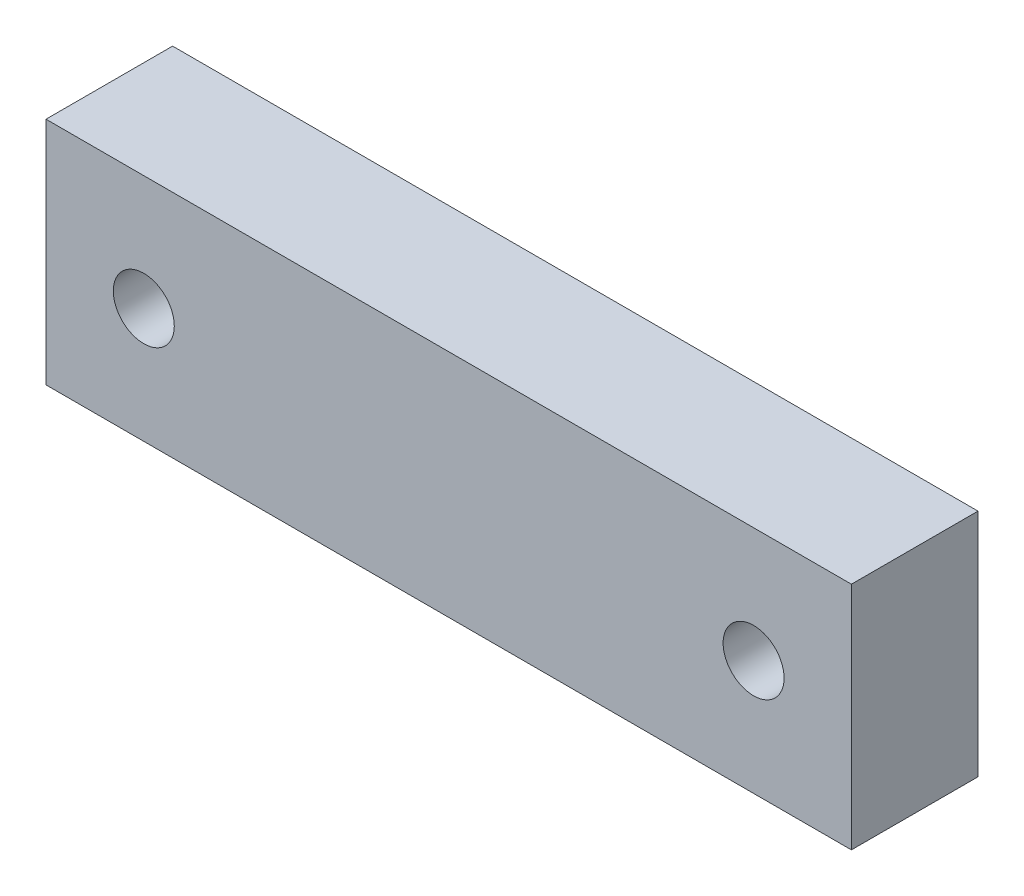
ISO-10303-21;
HEADER;
FILE_DESCRIPTION(('STEP AP214'),'2;1');
FILE_NAME('part.step','',(''),(''),'','','');
FILE_SCHEMA(('AUTOMOTIVE_DESIGN { 1 0 10303 214 1 1 1 1 }'));
ENDSEC;
DATA;
#1=APPLICATION_CONTEXT('core data for automotive mechanical design processes');
#2=APPLICATION_PROTOCOL_DEFINITION('international standard','automotive_design',2000,#1);
#3=PRODUCT_CONTEXT('',#1,'mechanical');
#4=PRODUCT('Part','Part','',(#3));
#5=PRODUCT_RELATED_PRODUCT_CATEGORY('part','',(#4));
#6=PRODUCT_DEFINITION_FORMATION('','',#4);
#7=PRODUCT_DEFINITION_CONTEXT('part definition',#1,'design');
#8=PRODUCT_DEFINITION('design','',#6,#7);
#9=PRODUCT_DEFINITION_SHAPE('','',#8);
#10=(LENGTH_UNIT() NAMED_UNIT(*) SI_UNIT(.MILLI.,.METRE.));
#11=(NAMED_UNIT(*) PLANE_ANGLE_UNIT() SI_UNIT($,.RADIAN.));
#12=(NAMED_UNIT(*) SI_UNIT($,.STERADIAN.) SOLID_ANGLE_UNIT());
#13=UNCERTAINTY_MEASURE_WITH_UNIT(LENGTH_MEASURE(1.E-05),#10,'distance_accuracy_value','');
#14=(GEOMETRIC_REPRESENTATION_CONTEXT(3) GLOBAL_UNCERTAINTY_ASSIGNED_CONTEXT((#13)) GLOBAL_UNIT_ASSIGNED_CONTEXT((#10,
#11,#12)) REPRESENTATION_CONTEXT('',''));
#15=CARTESIAN_POINT('',(0.,0.,0.));
#16=DIRECTION('',(0.,0.,1.));
#17=DIRECTION('',(1.,0.,0.));
#18=AXIS2_PLACEMENT_3D('',#15,#16,#17);
#19=CARTESIAN_POINT('',(0.,0.,11.0028734966437));
#20=DIRECTION('',(0.,0.,1.));
#21=DIRECTION('',(1.,0.,0.));
#22=AXIS2_PLACEMENT_3D('',#19,#20,#21);
#23=PLANE('',#22);
#24=CARTESIAN_POINT('',(26.5000000000002,-52.5,11.0028734966437));
#25=DIRECTION('',(0.,0.,1.));
#26=DIRECTION('',(1.,0.,0.));
#27=AXIS2_PLACEMENT_3D('',#24,#25,#26);
#28=CIRCLE('',#27,2.65);
#29=CARTESIAN_POINT('',(29.1500000000002,-52.5,11.0028734966437));
#30=VERTEX_POINT('',#29);
#31=EDGE_CURVE('E102',#30,#30,#28,.T.);
#32=ORIENTED_EDGE('',*,*,#31,.F.);
#33=EDGE_LOOP('',(#32));
#34=FACE_BOUND('',#33,.T.);
#35=DIRECTION('',(0.,-1.,0.));
#36=VECTOR('',#35,1.);
#37=CARTESIAN_POINT('',(-35.,-42.5,11.0028734966437));
#38=LINE('',#37,#36);
#39=CARTESIAN_POINT('',(-35.,-42.5,11.0028734966437));
#40=VERTEX_POINT('',#39);
#41=CARTESIAN_POINT('',(-35.,-62.5,11.0028734966437));
#42=VERTEX_POINT('',#41);
#43=EDGE_CURVE('E87',#40,#42,#38,.T.);
#44=ORIENTED_EDGE('',*,*,#43,.T.);
#45=DIRECTION('',(1.,0.,0.));
#46=VECTOR('',#45,1.);
#47=CARTESIAN_POINT('',(-35.,-62.5,11.0028734966437));
#48=LINE('',#47,#46);
#49=CARTESIAN_POINT('',(35.,-62.5,11.0028734966437));
#50=VERTEX_POINT('',#49);
#51=EDGE_CURVE('E82',#42,#50,#48,.T.);
#52=ORIENTED_EDGE('',*,*,#51,.T.);
#53=DIRECTION('',(0.,1.,0.));
#54=VECTOR('',#53,1.);
#55=CARTESIAN_POINT('',(35.,-42.5,11.0028734966437));
#56=LINE('',#55,#54);
#57=CARTESIAN_POINT('',(35.,-42.5,11.0028734966437));
#58=VERTEX_POINT('',#57);
#59=EDGE_CURVE('E85',#50,#58,#56,.T.);
#60=ORIENTED_EDGE('',*,*,#59,.T.);
#61=DIRECTION('',(-1.,0.,0.));
#62=VECTOR('',#61,1.);
#63=CARTESIAN_POINT('',(-35.,-42.5,11.0028734966437));
#64=LINE('',#63,#62);
#65=EDGE_CURVE('E52',#58,#40,#64,.T.);
#66=ORIENTED_EDGE('',*,*,#65,.T.);
#67=EDGE_LOOP('',(#44,#52,#60,#66));
#68=FACE_BOUND('',#67,.T.);
#69=CARTESIAN_POINT('',(-26.4999999999998,-52.5,11.0028734966437));
#70=DIRECTION('',(0.,0.,1.));
#71=DIRECTION('',(1.,0.,0.));
#72=AXIS2_PLACEMENT_3D('',#69,#70,#71);
#73=CIRCLE('',#72,2.65);
#74=CARTESIAN_POINT('',(-23.8499999999998,-52.5,11.0028734966437));
#75=VERTEX_POINT('',#74);
#76=EDGE_CURVE('E117',#75,#75,#73,.T.);
#77=ORIENTED_EDGE('',*,*,#76,.F.);
#78=EDGE_LOOP('',(#77));
#79=FACE_BOUND('',#78,.T.);
#80=ADVANCED_FACE('F35',(#34,#68,#79),#23,.T.);
#81=CARTESIAN_POINT('',(0.,0.,0.));
#82=DIRECTION('',(0.,0.,1.));
#83=DIRECTION('',(1.,0.,0.));
#84=AXIS2_PLACEMENT_3D('',#81,#82,#83);
#85=PLANE('',#84);
#86=DIRECTION('',(0.,-1.,0.));
#87=VECTOR('',#86,1.);
#88=CARTESIAN_POINT('',(-35.,-42.5,0.));
#89=LINE('',#88,#87);
#90=CARTESIAN_POINT('',(-35.,-42.5,0.));
#91=VERTEX_POINT('',#90);
#92=CARTESIAN_POINT('',(-35.,-62.5,0.));
#93=VERTEX_POINT('',#92);
#94=EDGE_CURVE('E99',#91,#93,#89,.T.);
#95=ORIENTED_EDGE('',*,*,#94,.F.);
#96=DIRECTION('',(-1.,0.,0.));
#97=VECTOR('',#96,1.);
#98=CARTESIAN_POINT('',(-35.,-42.5,0.));
#99=LINE('',#98,#97);
#100=CARTESIAN_POINT('',(35.,-42.5,0.));
#101=VERTEX_POINT('',#100);
#102=EDGE_CURVE('E75',#101,#91,#99,.T.);
#103=ORIENTED_EDGE('',*,*,#102,.F.);
#104=DIRECTION('',(0.,1.,0.));
#105=VECTOR('',#104,1.);
#106=CARTESIAN_POINT('',(35.,-42.5,0.));
#107=LINE('',#106,#105);
#108=CARTESIAN_POINT('',(35.,-62.5,0.));
#109=VERTEX_POINT('',#108);
#110=EDGE_CURVE('E69',#109,#101,#107,.T.);
#111=ORIENTED_EDGE('',*,*,#110,.F.);
#112=DIRECTION('',(1.,0.,0.));
#113=VECTOR('',#112,1.);
#114=CARTESIAN_POINT('',(-35.,-62.5,0.));
#115=LINE('',#114,#113);
#116=EDGE_CURVE('E91',#93,#109,#115,.T.);
#117=ORIENTED_EDGE('',*,*,#116,.F.);
#118=EDGE_LOOP('',(#95,#103,#111,#117));
#119=FACE_BOUND('',#118,.T.);
#120=CARTESIAN_POINT('',(26.5000000000002,-52.5,0.));
#121=DIRECTION('',(0.,0.,1.));
#122=DIRECTION('',(1.,0.,0.));
#123=AXIS2_PLACEMENT_3D('',#120,#121,#122);
#124=CIRCLE('',#123,2.65);
#125=CARTESIAN_POINT('',(29.1500000000002,-52.5,0.));
#126=VERTEX_POINT('',#125);
#127=EDGE_CURVE('E114',#126,#126,#124,.T.);
#128=ORIENTED_EDGE('',*,*,#127,.T.);
#129=EDGE_LOOP('',(#128));
#130=FACE_BOUND('',#129,.T.);
#131=CARTESIAN_POINT('',(-26.4999999999998,-52.5,0.));
#132=DIRECTION('',(0.,0.,1.));
#133=DIRECTION('',(1.,0.,0.));
#134=AXIS2_PLACEMENT_3D('',#131,#132,#133);
#135=CIRCLE('',#134,2.65);
#136=CARTESIAN_POINT('',(-23.8499999999998,-52.5,0.));
#137=VERTEX_POINT('',#136);
#138=EDGE_CURVE('E120',#137,#137,#135,.T.);
#139=ORIENTED_EDGE('',*,*,#138,.T.);
#140=EDGE_LOOP('',(#139));
#141=FACE_BOUND('',#140,.T.);
#142=ADVANCED_FACE('F110',(#119,#130,#141),#85,.F.);
#143=CARTESIAN_POINT('',(-35.,-42.5,11.0028734966437));
#144=DIRECTION('',(1.,0.,0.));
#145=DIRECTION('',(0.,1.,0.));
#146=AXIS2_PLACEMENT_3D('',#143,#144,#145);
#147=PLANE('',#146);
#148=ORIENTED_EDGE('',*,*,#94,.T.);
#149=DIRECTION('',(0.,0.,-1.));
#150=VECTOR('',#149,1.);
#151=CARTESIAN_POINT('',(-35.,-62.5,11.0028734966437));
#152=LINE('',#151,#150);
#153=EDGE_CURVE('E11',#42,#93,#152,.T.);
#154=ORIENTED_EDGE('',*,*,#153,.F.);
#155=ORIENTED_EDGE('',*,*,#43,.F.);
#156=DIRECTION('',(0.,0.,-1.));
#157=VECTOR('',#156,1.);
#158=CARTESIAN_POINT('',(-35.,-42.5,11.0028734966437));
#159=LINE('',#158,#157);
#160=EDGE_CURVE('E95',#40,#91,#159,.T.);
#161=ORIENTED_EDGE('',*,*,#160,.T.);
#162=EDGE_LOOP('',(#148,#154,#155,#161));
#163=FACE_BOUND('',#162,.T.);
#164=ADVANCED_FACE('F37',(#163),#147,.F.);
#165=CARTESIAN_POINT('',(-35.,-62.5,11.0028734966437));
#166=DIRECTION('',(0.,1.,0.));
#167=DIRECTION('',(0.,0.,1.));
#168=AXIS2_PLACEMENT_3D('',#165,#166,#167);
#169=PLANE('',#168);
#170=ORIENTED_EDGE('',*,*,#116,.T.);
#171=DIRECTION('',(0.,0.,-1.));
#172=VECTOR('',#171,1.);
#173=CARTESIAN_POINT('',(35.,-62.5,11.0028734966437));
#174=LINE('',#173,#172);
#175=EDGE_CURVE('E44',#50,#109,#174,.T.);
#176=ORIENTED_EDGE('',*,*,#175,.F.);
#177=ORIENTED_EDGE('',*,*,#51,.F.);
#178=ORIENTED_EDGE('',*,*,#153,.T.);
#179=EDGE_LOOP('',(#170,#176,#177,#178));
#180=FACE_BOUND('',#179,.T.);
#181=ADVANCED_FACE('F90',(#180),#169,.F.);
#182=CARTESIAN_POINT('',(35.,-42.5,11.0028734966437));
#183=DIRECTION('',(-1.,0.,0.));
#184=DIRECTION('',(0.,0.,1.));
#185=AXIS2_PLACEMENT_3D('',#182,#183,#184);
#186=PLANE('',#185);
#187=ORIENTED_EDGE('',*,*,#110,.T.);
#188=DIRECTION('',(0.,0.,-1.));
#189=VECTOR('',#188,1.);
#190=CARTESIAN_POINT('',(35.,-42.5,11.0028734966437));
#191=LINE('',#190,#189);
#192=EDGE_CURVE('E92',#58,#101,#191,.T.);
#193=ORIENTED_EDGE('',*,*,#192,.F.);
#194=ORIENTED_EDGE('',*,*,#59,.F.);
#195=ORIENTED_EDGE('',*,*,#175,.T.);
#196=EDGE_LOOP('',(#187,#193,#194,#195));
#197=FACE_BOUND('',#196,.T.);
#198=ADVANCED_FACE('F93',(#197),#186,.F.);
#199=CARTESIAN_POINT('',(-35.,-42.5,11.0028734966437));
#200=DIRECTION('',(0.,-1.,0.));
#201=DIRECTION('',(0.,0.,-1.));
#202=AXIS2_PLACEMENT_3D('',#199,#200,#201);
#203=PLANE('',#202);
#204=ORIENTED_EDGE('',*,*,#102,.T.);
#205=ORIENTED_EDGE('',*,*,#160,.F.);
#206=ORIENTED_EDGE('',*,*,#65,.F.);
#207=ORIENTED_EDGE('',*,*,#192,.T.);
#208=EDGE_LOOP('',(#204,#205,#206,#207));
#209=FACE_BOUND('',#208,.T.);
#210=ADVANCED_FACE('F107',(#209),#203,.F.);
#211=CARTESIAN_POINT('',(26.5000000000002,-52.5,11.0028734966437));
#212=DIRECTION('',(0.,0.,-1.));
#213=DIRECTION('',(-1.,0.,0.));
#214=AXIS2_PLACEMENT_3D('',#211,#212,#213);
#215=CYLINDRICAL_SURFACE('',#214,2.65);
#216=ORIENTED_EDGE('',*,*,#31,.T.);
#217=EDGE_LOOP('',(#216));
#218=FACE_BOUND('',#217,.T.);
#219=ORIENTED_EDGE('',*,*,#127,.F.);
#220=EDGE_LOOP('',(#219));
#221=FACE_BOUND('',#220,.T.);
#222=ADVANCED_FACE('F137',(#218,#221),#215,.F.);
#223=CARTESIAN_POINT('',(-26.4999999999998,-52.5,11.0028734966437));
#224=DIRECTION('',(0.,0.,-1.));
#225=DIRECTION('',(-1.,0.,0.));
#226=AXIS2_PLACEMENT_3D('',#223,#224,#225);
#227=CYLINDRICAL_SURFACE('',#226,2.65);
#228=ORIENTED_EDGE('',*,*,#76,.T.);
#229=EDGE_LOOP('',(#228));
#230=FACE_BOUND('',#229,.T.);
#231=ORIENTED_EDGE('',*,*,#138,.F.);
#232=EDGE_LOOP('',(#231));
#233=FACE_BOUND('',#232,.T.);
#234=ADVANCED_FACE('F126',(#230,#233),#227,.F.);
#235=CLOSED_SHELL('',(#80,#142,#164,#181,#198,#210,#222,#234));
#236=MANIFOLD_SOLID_BREP('B2',#235);
#237=ADVANCED_BREP_SHAPE_REPRESENTATION('',(#18,#236),#14);
#238=SHAPE_DEFINITION_REPRESENTATION(#9,#237);
ENDSEC;
END-ISO-10303-21;
